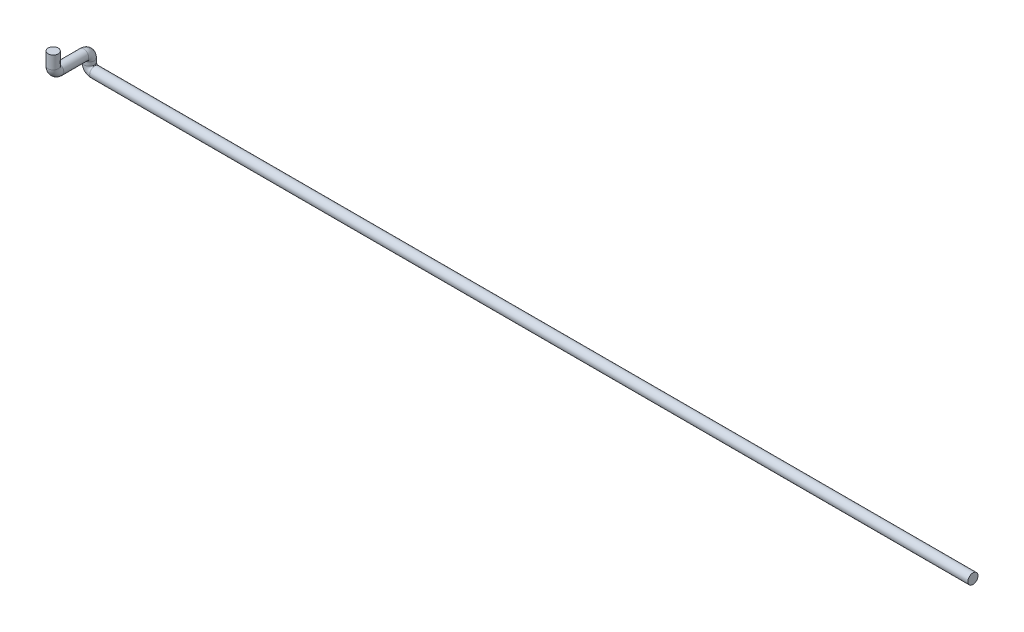
ISO-10303-21;
HEADER;
FILE_DESCRIPTION(('STEP AP214'),'2;1');
FILE_NAME('part.step','',(''),(''),'','','');
FILE_SCHEMA(('AUTOMOTIVE_DESIGN { 1 0 10303 214 1 1 1 1 }'));
ENDSEC;
DATA;
#1=APPLICATION_CONTEXT('core data for automotive mechanical design processes');
#2=APPLICATION_PROTOCOL_DEFINITION('international standard','automotive_design',2000,#1);
#3=PRODUCT_CONTEXT('',#1,'mechanical');
#4=PRODUCT('Part','Part','',(#3));
#5=PRODUCT_RELATED_PRODUCT_CATEGORY('part','',(#4));
#6=PRODUCT_DEFINITION_FORMATION('','',#4);
#7=PRODUCT_DEFINITION_CONTEXT('part definition',#1,'design');
#8=PRODUCT_DEFINITION('design','',#6,#7);
#9=PRODUCT_DEFINITION_SHAPE('','',#8);
#10=(LENGTH_UNIT() NAMED_UNIT(*) SI_UNIT(.MILLI.,.METRE.));
#11=(NAMED_UNIT(*) PLANE_ANGLE_UNIT() SI_UNIT($,.RADIAN.));
#12=(NAMED_UNIT(*) SI_UNIT($,.STERADIAN.) SOLID_ANGLE_UNIT());
#13=UNCERTAINTY_MEASURE_WITH_UNIT(LENGTH_MEASURE(1.E-05),#10,'distance_accuracy_value','');
#14=(GEOMETRIC_REPRESENTATION_CONTEXT(3) GLOBAL_UNCERTAINTY_ASSIGNED_CONTEXT((#13)) GLOBAL_UNIT_ASSIGNED_CONTEXT((#10,
#11,#12)) REPRESENTATION_CONTEXT('',''));
#15=CARTESIAN_POINT('',(0.,0.,0.));
#16=DIRECTION('',(0.,0.,1.));
#17=DIRECTION('',(1.,0.,0.));
#18=AXIS2_PLACEMENT_3D('',#15,#16,#17);
#19=CARTESIAN_POINT('',(0.,0.,0.));
#20=DIRECTION('',(1.,0.,0.));
#21=DIRECTION('',(0.,0.,-1.));
#22=AXIS2_PLACEMENT_3D('',#19,#20,#21);
#23=PLANE('',#22);
#24=CARTESIAN_POINT('',(0.,0.,0.));
#25=DIRECTION('',(1.,0.,0.));
#26=DIRECTION('',(0.,0.,-1.));
#27=AXIS2_PLACEMENT_3D('',#24,#25,#26);
#28=CIRCLE('',#27,13.7);
#29=CARTESIAN_POINT('',(0.,0.,-13.7));
#30=VERTEX_POINT('',#29);
#31=EDGE_CURVE('E49',#30,#30,#28,.T.);
#32=ORIENTED_EDGE('',*,*,#31,.T.);
#33=EDGE_LOOP('',(#32));
#34=FACE_BOUND('',#33,.T.);
#35=ADVANCED_FACE('F37',(#34),#23,.T.);
#36=CARTESIAN_POINT('',(-2389.,90.,97.5));
#37=DIRECTION('',(0.,-1.,0.));
#38=DIRECTION('',(0.,0.,-1.));
#39=AXIS2_PLACEMENT_3D('',#36,#37,#38);
#40=PLANE('',#39);
#41=CARTESIAN_POINT('',(-2389.,90.,97.5));
#42=DIRECTION('',(0.,-1.,0.));
#43=DIRECTION('',(0.,0.,-1.));
#44=AXIS2_PLACEMENT_3D('',#41,#42,#43);
#45=CIRCLE('',#44,13.7);
#46=CARTESIAN_POINT('',(-2389.,90.,83.8));
#47=VERTEX_POINT('',#46);
#48=EDGE_CURVE('E11',#47,#47,#45,.T.);
#49=ORIENTED_EDGE('',*,*,#48,.F.);
#50=EDGE_LOOP('',(#49));
#51=FACE_BOUND('',#50,.T.);
#52=ADVANCED_FACE('F55',(#51),#40,.F.);
#53=CARTESIAN_POINT('',(0.,0.,0.));
#54=DIRECTION('',(-1.,0.,0.));
#55=DIRECTION('',(0.,0.,1.));
#56=AXIS2_PLACEMENT_3D('',#53,#54,#55);
#57=CYLINDRICAL_SURFACE('',#56,13.7);
#58=CARTESIAN_POINT('',(-2374.,0.,0.));
#59=DIRECTION('',(1.,0.,0.));
#60=DIRECTION('',(0.,0.,-1.));
#61=AXIS2_PLACEMENT_3D('',#58,#59,#60);
#62=CIRCLE('',#61,13.7);
#63=CARTESIAN_POINT('',(-2374.,-13.7000000000001,0.));
#64=VERTEX_POINT('',#63);
#65=EDGE_CURVE('E97',#64,#64,#62,.T.);
#66=ORIENTED_EDGE('',*,*,#65,.T.);
#67=EDGE_LOOP('',(#66));
#68=FACE_BOUND('',#67,.T.);
#69=ORIENTED_EDGE('',*,*,#31,.F.);
#70=EDGE_LOOP('',(#69));
#71=FACE_BOUND('',#70,.T.);
#72=ADVANCED_FACE('F57',(#68,#71),#57,.T.);
#73=CARTESIAN_POINT('',(-2374.,15.,0.));
#74=DIRECTION('',(0.,0.,-1.));
#75=DIRECTION('',(-1.,0.,0.));
#76=AXIS2_PLACEMENT_3D('',#73,#74,#75);
#77=TOROIDAL_SURFACE('',#76,15.0000000000001,13.7);
#78=CARTESIAN_POINT('',(-2389.,15.,0.));
#79=DIRECTION('',(0.,-1.,0.));
#80=DIRECTION('',(0.,0.,-1.));
#81=AXIS2_PLACEMENT_3D('',#78,#79,#80);
#82=CIRCLE('',#81,13.7);
#83=CARTESIAN_POINT('',(-2402.7,15.,0.));
#84=VERTEX_POINT('',#83);
#85=EDGE_CURVE('E94',#84,#84,#82,.T.);
#86=CARTESIAN_POINT('',(-2374.,15.,0.));
#87=DIRECTION('',(0.,0.,-1.));
#88=DIRECTION('',(-1.,0.,0.));
#89=AXIS2_PLACEMENT_3D('',#86,#87,#88);
#90=CIRCLE('',#89,28.7000000000001);
#91=EDGE_CURVE('',#64,#84,#90,.T.);
#92=ORIENTED_EDGE('',*,*,#65,.F.);
#93=ORIENTED_EDGE('',*,*,#85,.T.);
#94=ORIENTED_EDGE('',*,*,#91,.T.);
#95=ORIENTED_EDGE('',*,*,#91,.F.);
#96=EDGE_LOOP('',(#92,#94,#93,#95));
#97=FACE_BOUND('',#96,.T.);
#98=ADVANCED_FACE('F62',(#97),#77,.T.);
#99=CARTESIAN_POINT('',(-2389.,15.,0.));
#100=DIRECTION('',(0.,1.,0.));
#101=DIRECTION('',(0.,0.,1.));
#102=AXIS2_PLACEMENT_3D('',#99,#100,#101);
#103=CYLINDRICAL_SURFACE('',#102,13.7);
#104=CARTESIAN_POINT('',(-2389.,25.,0.));
#105=DIRECTION('',(0.,-1.,0.));
#106=DIRECTION('',(0.,0.,-1.));
#107=AXIS2_PLACEMENT_3D('',#104,#105,#106);
#108=CIRCLE('',#107,13.7);
#109=CARTESIAN_POINT('',(-2389.,25.,-13.7));
#110=VERTEX_POINT('',#109);
#111=EDGE_CURVE('E99',#110,#110,#108,.T.);
#112=ORIENTED_EDGE('',*,*,#111,.T.);
#113=EDGE_LOOP('',(#112));
#114=FACE_BOUND('',#113,.T.);
#115=ORIENTED_EDGE('',*,*,#85,.F.);
#116=EDGE_LOOP('',(#115));
#117=FACE_BOUND('',#116,.T.);
#118=ADVANCED_FACE('F82',(#114,#117),#103,.T.);
#119=CARTESIAN_POINT('',(-2389.,25.,15.));
#120=DIRECTION('',(1.,0.,0.));
#121=DIRECTION('',(0.,0.,-1.));
#122=AXIS2_PLACEMENT_3D('',#119,#120,#121);
#123=TOROIDAL_SURFACE('',#122,15.,13.7);
#124=CARTESIAN_POINT('',(-2389.,40.,15.));
#125=DIRECTION('',(0.,0.,-1.));
#126=DIRECTION('',(0.,1.,0.));
#127=AXIS2_PLACEMENT_3D('',#124,#125,#126);
#128=CIRCLE('',#127,13.7);
#129=CARTESIAN_POINT('',(-2389.,53.7,15.));
#130=VERTEX_POINT('',#129);
#131=EDGE_CURVE('E105',#130,#130,#128,.T.);
#132=CARTESIAN_POINT('',(-2389.,25.,15.));
#133=DIRECTION('',(1.,0.,0.));
#134=DIRECTION('',(0.,0.,-1.));
#135=AXIS2_PLACEMENT_3D('',#132,#133,#134);
#136=CIRCLE('',#135,28.7);
#137=EDGE_CURVE('',#110,#130,#136,.T.);
#138=ORIENTED_EDGE('',*,*,#111,.F.);
#139=ORIENTED_EDGE('',*,*,#131,.T.);
#140=ORIENTED_EDGE('',*,*,#137,.T.);
#141=ORIENTED_EDGE('',*,*,#137,.F.);
#142=EDGE_LOOP('',(#138,#140,#139,#141));
#143=FACE_BOUND('',#142,.T.);
#144=ADVANCED_FACE('F78',(#143),#123,.T.);
#145=CARTESIAN_POINT('',(-2389.,40.,15.));
#146=DIRECTION('',(0.,0.,1.));
#147=DIRECTION('',(1.,0.,0.));
#148=AXIS2_PLACEMENT_3D('',#145,#146,#147);
#149=CYLINDRICAL_SURFACE('',#148,13.7);
#150=CARTESIAN_POINT('',(-2389.,40.,82.5));
#151=DIRECTION('',(0.,0.,-1.));
#152=DIRECTION('',(0.,1.,0.));
#153=AXIS2_PLACEMENT_3D('',#150,#151,#152);
#154=CIRCLE('',#153,13.7);
#155=CARTESIAN_POINT('',(-2389.,26.3,82.5));
#156=VERTEX_POINT('',#155);
#157=EDGE_CURVE('E108',#156,#156,#154,.T.);
#158=ORIENTED_EDGE('',*,*,#157,.T.);
#159=EDGE_LOOP('',(#158));
#160=FACE_BOUND('',#159,.T.);
#161=ORIENTED_EDGE('',*,*,#131,.F.);
#162=EDGE_LOOP('',(#161));
#163=FACE_BOUND('',#162,.T.);
#164=ADVANCED_FACE('F72',(#160,#163),#149,.T.);
#165=CARTESIAN_POINT('',(-2389.,55.,82.5));
#166=DIRECTION('',(-1.,0.,0.));
#167=DIRECTION('',(0.,0.,1.));
#168=AXIS2_PLACEMENT_3D('',#165,#166,#167);
#169=TOROIDAL_SURFACE('',#168,15.,13.7);
#170=CARTESIAN_POINT('',(-2389.,55.,97.5));
#171=DIRECTION('',(0.,-1.,0.));
#172=DIRECTION('',(0.,0.,-1.));
#173=AXIS2_PLACEMENT_3D('',#170,#171,#172);
#174=CIRCLE('',#173,13.7);
#175=CARTESIAN_POINT('',(-2389.,55.,111.2));
#176=VERTEX_POINT('',#175);
#177=EDGE_CURVE('E44',#176,#176,#174,.T.);
#178=CARTESIAN_POINT('',(-2389.,55.,82.5));
#179=DIRECTION('',(-1.,0.,0.));
#180=DIRECTION('',(0.,0.,1.));
#181=AXIS2_PLACEMENT_3D('',#178,#179,#180);
#182=CIRCLE('',#181,28.7);
#183=EDGE_CURVE('',#156,#176,#182,.T.);
#184=ORIENTED_EDGE('',*,*,#157,.F.);
#185=ORIENTED_EDGE('',*,*,#177,.T.);
#186=ORIENTED_EDGE('',*,*,#183,.T.);
#187=ORIENTED_EDGE('',*,*,#183,.F.);
#188=EDGE_LOOP('',(#184,#186,#185,#187));
#189=FACE_BOUND('',#188,.T.);
#190=ADVANCED_FACE('F68',(#189),#169,.T.);
#191=CARTESIAN_POINT('',(-2389.,55.,97.5));
#192=DIRECTION('',(0.,1.,0.));
#193=DIRECTION('',(0.,0.,1.));
#194=AXIS2_PLACEMENT_3D('',#191,#192,#193);
#195=CYLINDRICAL_SURFACE('',#194,13.7);
#196=ORIENTED_EDGE('',*,*,#48,.T.);
#197=EDGE_LOOP('',(#196));
#198=FACE_BOUND('',#197,.T.);
#199=ORIENTED_EDGE('',*,*,#177,.F.);
#200=EDGE_LOOP('',(#199));
#201=FACE_BOUND('',#200,.T.);
#202=ADVANCED_FACE('F52',(#198,#201),#195,.T.);
#203=CLOSED_SHELL('',(#35,#52,#72,#98,#118,#144,#164,#190,#202));
#204=MANIFOLD_SOLID_BREP('B2',#203);
#205=ADVANCED_BREP_SHAPE_REPRESENTATION('',(#18,#204),#14);
#206=SHAPE_DEFINITION_REPRESENTATION(#9,#205);
ENDSEC;
END-ISO-10303-21;
